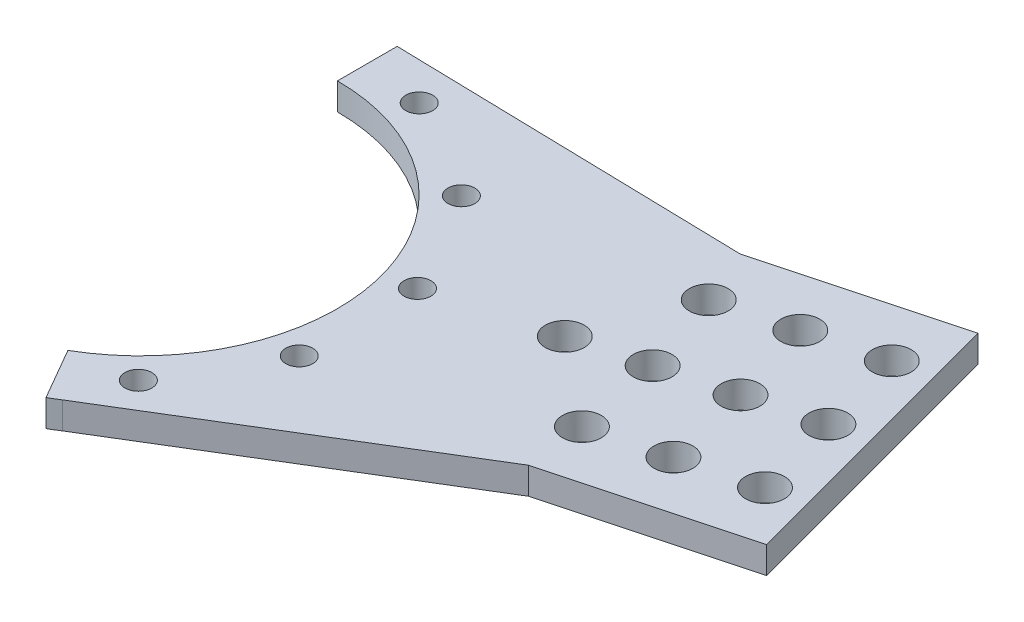
ISO-10303-21;
HEADER;
FILE_DESCRIPTION(('STEP AP214'),'2;1');
FILE_NAME('part.step','',(''),(''),'','','');
FILE_SCHEMA(('AUTOMOTIVE_DESIGN { 1 0 10303 214 1 1 1 1 }'));
ENDSEC;
DATA;
#1=APPLICATION_CONTEXT('core data for automotive mechanical design processes');
#2=APPLICATION_PROTOCOL_DEFINITION('international standard','automotive_design',2000,#1);
#3=PRODUCT_CONTEXT('',#1,'mechanical');
#4=PRODUCT('Part','Part','',(#3));
#5=PRODUCT_RELATED_PRODUCT_CATEGORY('part','',(#4));
#6=PRODUCT_DEFINITION_FORMATION('','',#4);
#7=PRODUCT_DEFINITION_CONTEXT('part definition',#1,'design');
#8=PRODUCT_DEFINITION('design','',#6,#7);
#9=PRODUCT_DEFINITION_SHAPE('','',#8);
#10=(LENGTH_UNIT() NAMED_UNIT(*) SI_UNIT(.MILLI.,.METRE.));
#11=(NAMED_UNIT(*) PLANE_ANGLE_UNIT() SI_UNIT($,.RADIAN.));
#12=(NAMED_UNIT(*) SI_UNIT($,.STERADIAN.) SOLID_ANGLE_UNIT());
#13=UNCERTAINTY_MEASURE_WITH_UNIT(LENGTH_MEASURE(1.E-05),#10,'distance_accuracy_value','');
#14=(GEOMETRIC_REPRESENTATION_CONTEXT(3) GLOBAL_UNCERTAINTY_ASSIGNED_CONTEXT((#13)) GLOBAL_UNIT_ASSIGNED_CONTEXT((#10,
#11,#12)) REPRESENTATION_CONTEXT('',''));
#15=CARTESIAN_POINT('',(0.,0.,0.));
#16=DIRECTION('',(0.,0.,1.));
#17=DIRECTION('',(1.,0.,0.));
#18=AXIS2_PLACEMENT_3D('',#15,#16,#17);
#19=CARTESIAN_POINT('',(56.0236979247659,-7.75,-15.0115046159464));
#20=DIRECTION('',(0.,1.,0.));
#21=DIRECTION('',(0.,0.,1.));
#22=AXIS2_PLACEMENT_3D('',#19,#20,#21);
#23=CYLINDRICAL_SURFACE('',#22,3.25000000000001);
#24=CARTESIAN_POINT('',(56.0236979247659,-2.25,-15.0115046159464));
#25=DIRECTION('',(0.,-1.,0.));
#26=DIRECTION('',(0.,0.,-1.));
#27=AXIS2_PLACEMENT_3D('',#24,#25,#26);
#28=CIRCLE('',#27,3.25000000000001);
#29=CARTESIAN_POINT('',(56.0236979247659,-2.25,-18.2615046159464));
#30=VERTEX_POINT('',#29);
#31=EDGE_CURVE('E42',#30,#30,#28,.T.);
#32=ORIENTED_EDGE('',*,*,#31,.T.);
#33=EDGE_LOOP('',(#32));
#34=FACE_BOUND('',#33,.T.);
#35=CARTESIAN_POINT('',(56.0236979247659,2.25,-15.0115046159464));
#36=DIRECTION('',(0.,1.,0.));
#37=DIRECTION('',(0.,0.,1.));
#38=AXIS2_PLACEMENT_3D('',#35,#36,#37);
#39=CIRCLE('',#38,3.25000000000001);
#40=CARTESIAN_POINT('',(56.0236979247659,2.25,-11.7615046159464));
#41=VERTEX_POINT('',#40);
#42=EDGE_CURVE('E11',#41,#41,#39,.T.);
#43=ORIENTED_EDGE('',*,*,#42,.T.);
#44=EDGE_LOOP('',(#43));
#45=FACE_BOUND('',#44,.T.);
#46=ADVANCED_FACE('F35',(#34,#45),#23,.F.);
#47=CARTESIAN_POINT('',(67.6148078402347,-7.75,-18.1173331571768));
#48=DIRECTION('',(0.,1.,0.));
#49=DIRECTION('',(0.,0.,1.));
#50=AXIS2_PLACEMENT_3D('',#47,#48,#49);
#51=CYLINDRICAL_SURFACE('',#50,3.25000000000001);
#52=CARTESIAN_POINT('',(67.6148078402347,-2.25,-18.1173331571768));
#53=DIRECTION('',(0.,-1.,0.));
#54=DIRECTION('',(0.,0.,-1.));
#55=AXIS2_PLACEMENT_3D('',#52,#53,#54);
#56=CIRCLE('',#55,3.25000000000001);
#57=CARTESIAN_POINT('',(67.6148078402347,-2.25,-21.3673331571768));
#58=VERTEX_POINT('',#57);
#59=EDGE_CURVE('E196',#58,#58,#56,.T.);
#60=ORIENTED_EDGE('',*,*,#59,.T.);
#61=EDGE_LOOP('',(#60));
#62=FACE_BOUND('',#61,.T.);
#63=CARTESIAN_POINT('',(67.6148078402347,2.25,-18.1173331571768));
#64=DIRECTION('',(0.,1.,0.));
#65=DIRECTION('',(0.,0.,1.));
#66=AXIS2_PLACEMENT_3D('',#63,#64,#65);
#67=CIRCLE('',#66,3.25000000000001);
#68=CARTESIAN_POINT('',(67.6148078402347,2.25,-14.8673331571768));
#69=VERTEX_POINT('',#68);
#70=EDGE_CURVE('E204',#69,#69,#67,.T.);
#71=ORIENTED_EDGE('',*,*,#70,.T.);
#72=EDGE_LOOP('',(#71));
#73=FACE_BOUND('',#72,.T.);
#74=ADVANCED_FACE('F230',(#62,#73),#51,.F.);
#75=CARTESIAN_POINT('',(0.,2.25,0.));
#76=DIRECTION('',(0.,-1.,0.));
#77=DIRECTION('',(0.,0.,-1.));
#78=AXIS2_PLACEMENT_3D('',#75,#76,#77);
#79=CYLINDRICAL_SURFACE('',#78,43.);
#80=DIRECTION('',(0.,-1.,0.));
#81=VECTOR('',#80,1.);
#82=CARTESIAN_POINT('',(23.2297705515369,2.25,36.1853252040513));
#83=LINE('',#82,#81);
#84=CARTESIAN_POINT('',(23.2297705515366,2.25,36.1853252040515));
#85=VERTEX_POINT('',#84);
#86=CARTESIAN_POINT('',(23.2297705515366,-2.25,36.1853252040515));
#87=VERTEX_POINT('',#86);
#88=EDGE_CURVE('E49',#85,#87,#83,.T.);
#89=ORIENTED_EDGE('',*,*,#88,.F.);
#90=CARTESIAN_POINT('',(0.,2.25,0.));
#91=DIRECTION('',(0.,1.,0.));
#92=DIRECTION('',(0.,0.,-1.));
#93=AXIS2_PLACEMENT_3D('',#90,#91,#92);
#94=CIRCLE('',#93,43.);
#95=CARTESIAN_POINT('',(21.4999999999998,2.25,37.239092362731));
#96=VERTEX_POINT('',#95);
#97=EDGE_CURVE('E169',#96,#85,#94,.T.);
#98=ORIENTED_EDGE('',*,*,#97,.F.);
#99=DIRECTION('',(0.,-1.,0.));
#100=VECTOR('',#99,1.);
#101=CARTESIAN_POINT('',(21.4999999999998,2.25,37.239092362731));
#102=LINE('',#101,#100);
#103=CARTESIAN_POINT('',(21.4999999999998,-2.25,37.239092362731));
#104=VERTEX_POINT('',#103);
#105=EDGE_CURVE('E178',#96,#104,#102,.T.);
#106=ORIENTED_EDGE('',*,*,#105,.T.);
#107=CARTESIAN_POINT('',(0.,-2.25,0.));
#108=DIRECTION('',(0.,1.,0.));
#109=DIRECTION('',(0.,0.,-1.));
#110=AXIS2_PLACEMENT_3D('',#107,#108,#109);
#111=CIRCLE('',#110,43.);
#112=EDGE_CURVE('E54',#104,#87,#111,.T.);
#113=ORIENTED_EDGE('',*,*,#112,.T.);
#114=EDGE_LOOP('',(#89,#98,#106,#113));
#115=FACE_BOUND('',#114,.T.);
#116=ADVANCED_FACE('F234',(#115),#79,.T.);
#117=CARTESIAN_POINT('',(103.06305875647,2.25,-1.73375885302606));
#118=DIRECTION('',(-0.258819045102531,0.,-0.965925826289065));
#119=DIRECTION('',(-0.965925826289066,0.,0.258819045102531));
#120=AXIS2_PLACEMENT_3D('',#117,#118,#119);
#121=PLANE('',#120);
#122=DIRECTION('',(0.,-1.,0.));
#123=VECTOR('',#122,1.);
#124=CARTESIAN_POINT('',(71.6635685232573,2.25,6.67970919771229));
#125=LINE('',#124,#123);
#126=CARTESIAN_POINT('',(71.6635685232573,2.25,6.67970919771258));
#127=VERTEX_POINT('',#126);
#128=CARTESIAN_POINT('',(71.6635685232573,-2.25,6.67970919771229));
#129=VERTEX_POINT('',#128);
#130=EDGE_CURVE('E126',#127,#129,#125,.T.);
#131=ORIENTED_EDGE('',*,*,#130,.T.);
#132=DIRECTION('',(0.965925826289065,0.,-0.258819045102531));
#133=VECTOR('',#132,1.);
#134=CARTESIAN_POINT('',(103.06305875647,-2.25,-1.73375885302606));
#135=LINE('',#134,#133);
#136=CARTESIAN_POINT('',(103.06305875647,-2.25,-1.73375885302606));
#137=VERTEX_POINT('',#136);
#138=EDGE_CURVE('E111',#129,#137,#135,.T.);
#139=ORIENTED_EDGE('',*,*,#138,.T.);
#140=DIRECTION('',(0.,-1.,0.));
#141=VECTOR('',#140,1.);
#142=CARTESIAN_POINT('',(103.06305875647,2.25,-1.73375885302606));
#143=LINE('',#142,#141);
#144=CARTESIAN_POINT('',(103.06305875647,2.25,-1.73375885302606));
#145=VERTEX_POINT('',#144);
#146=EDGE_CURVE('E161',#145,#137,#143,.T.);
#147=ORIENTED_EDGE('',*,*,#146,.F.);
#148=DIRECTION('',(0.965925826289065,0.,-0.258819045102531));
#149=VECTOR('',#148,1.);
#150=CARTESIAN_POINT('',(103.06305875647,2.25,-1.73375885302606));
#151=LINE('',#150,#149);
#152=EDGE_CURVE('E128',#127,#145,#151,.T.);
#153=ORIENTED_EDGE('',*,*,#152,.F.);
#154=EDGE_LOOP('',(#131,#139,#147,#153));
#155=FACE_BOUND('',#154,.T.);
#156=ADVANCED_FACE('F127',(#155),#121,.F.);
#157=DIRECTION('',(0.,-1.,0.));
#158=VECTOR('',#157,1.);
#159=CARTESIAN_POINT('',(2.0249088196889,2.25,-42.9522961466782));
#160=LINE('',#159,#158);
#161=CARTESIAN_POINT('',(2.02490881968804,-2.25,-42.9522961466782));
#162=VERTEX_POINT('',#161);
#163=CARTESIAN_POINT('',(2.02490881968804,2.25,-42.9522961466782));
#164=VERTEX_POINT('',#163);
#165=EDGE_CURVE('E152',#162,#164,#160,.F.);
#166=ORIENTED_EDGE('',*,*,#165,.F.);
#167=CARTESIAN_POINT('',(0.,-2.25,-43.));
#168=VERTEX_POINT('',#167);
#169=EDGE_CURVE('E168',#162,#168,#111,.T.);
#170=ORIENTED_EDGE('',*,*,#169,.T.);
#171=DIRECTION('',(0.,-1.,0.));
#172=VECTOR('',#171,1.);
#173=CARTESIAN_POINT('',(0.,2.25,-43.));
#174=LINE('',#173,#172);
#175=CARTESIAN_POINT('',(0.,2.25,-43.));
#176=VERTEX_POINT('',#175);
#177=EDGE_CURVE('E193',#176,#168,#174,.T.);
#178=ORIENTED_EDGE('',*,*,#177,.F.);
#179=EDGE_CURVE('E172',#164,#176,#94,.T.);
#180=ORIENTED_EDGE('',*,*,#179,.F.);
#181=EDGE_LOOP('',(#166,#170,#178,#180));
#182=FACE_BOUND('',#181,.T.);
#183=ADVANCED_FACE('F240',(#182),#79,.T.);
#184=CARTESIAN_POINT('',(90.1221065013434,2.25,-50.0300501674793));
#185=DIRECTION('',(0.258819045102531,0.,0.965925826289065));
#186=DIRECTION('',(0.965925826289066,0.,-0.258819045102531));
#187=AXIS2_PLACEMENT_3D('',#184,#185,#186);
#188=PLANE('',#187);
#189=DIRECTION('',(0.,-1.,0.));
#190=VECTOR('',#189,1.);
#191=CARTESIAN_POINT('',(58.722616268131,2.25,-41.6165821167408));
#192=LINE('',#191,#190);
#193=CARTESIAN_POINT('',(58.722616268131,2.25,-41.6165821167408));
#194=VERTEX_POINT('',#193);
#195=CARTESIAN_POINT('',(58.722616268131,-2.25,-41.6165821167408));
#196=VERTEX_POINT('',#195);
#197=EDGE_CURVE('E147',#194,#196,#192,.T.);
#198=ORIENTED_EDGE('',*,*,#197,.F.);
#199=DIRECTION('',(-0.965925826289066,0.,0.258819045102531));
#200=VECTOR('',#199,1.);
#201=CARTESIAN_POINT('',(90.1221065013434,2.25,-50.0300501674793));
#202=LINE('',#201,#200);
#203=CARTESIAN_POINT('',(90.1221065013434,2.25,-50.0300501674793));
#204=VERTEX_POINT('',#203);
#205=EDGE_CURVE('E157',#204,#194,#202,.T.);
#206=ORIENTED_EDGE('',*,*,#205,.F.);
#207=DIRECTION('',(0.,-1.,0.));
#208=VECTOR('',#207,1.);
#209=CARTESIAN_POINT('',(90.1221065013434,2.25,-50.0300501674793));
#210=LINE('',#209,#208);
#211=CARTESIAN_POINT('',(90.1221065013434,-2.25,-50.0300501674793));
#212=VERTEX_POINT('',#211);
#213=EDGE_CURVE('E165',#204,#212,#210,.T.);
#214=ORIENTED_EDGE('',*,*,#213,.T.);
#215=DIRECTION('',(-0.965925826289066,0.,0.258819045102531));
#216=VECTOR('',#215,1.);
#217=CARTESIAN_POINT('',(90.1221065013434,-2.25,-50.0300501674793));
#218=LINE('',#217,#216);
#219=EDGE_CURVE('E123',#212,#196,#218,.T.);
#220=ORIENTED_EDGE('',*,*,#219,.T.);
#221=EDGE_LOOP('',(#198,#206,#214,#220));
#222=FACE_BOUND('',#221,.T.);
#223=ADVANCED_FACE('F244',(#222),#188,.F.);
#224=CARTESIAN_POINT('',(0.,2.25,-33.));
#225=DIRECTION('',(1.,0.,0.));
#226=DIRECTION('',(0.,0.,-1.));
#227=AXIS2_PLACEMENT_3D('',#224,#225,#226);
#228=PLANE('',#227);
#229=DIRECTION('',(0.,0.,1.));
#230=VECTOR('',#229,1.);
#231=CARTESIAN_POINT('',(0.,-2.25,-33.));
#232=LINE('',#231,#230);
#233=CARTESIAN_POINT('',(0.,-2.25,-33.));
#234=VERTEX_POINT('',#233);
#235=EDGE_CURVE('E180',#168,#234,#232,.T.);
#236=ORIENTED_EDGE('',*,*,#235,.T.);
#237=DIRECTION('',(0.,-1.,0.));
#238=VECTOR('',#237,1.);
#239=CARTESIAN_POINT('',(0.,2.25,-33.));
#240=LINE('',#239,#238);
#241=CARTESIAN_POINT('',(0.,2.25,-33.));
#242=VERTEX_POINT('',#241);
#243=EDGE_CURVE('E190',#242,#234,#240,.T.);
#244=ORIENTED_EDGE('',*,*,#243,.F.);
#245=DIRECTION('',(0.,0.,1.));
#246=VECTOR('',#245,1.);
#247=CARTESIAN_POINT('',(0.,2.25,-33.));
#248=LINE('',#247,#246);
#249=EDGE_CURVE('E171',#176,#242,#248,.T.);
#250=ORIENTED_EDGE('',*,*,#249,.F.);
#251=ORIENTED_EDGE('',*,*,#177,.T.);
#252=EDGE_LOOP('',(#236,#244,#250,#251));
#253=FACE_BOUND('',#252,.T.);
#254=ADVANCED_FACE('F246',(#253),#228,.F.);
#255=CARTESIAN_POINT('',(0.,2.25,0.));
#256=DIRECTION('',(0.,-1.,0.));
#257=DIRECTION('',(0.,0.,-1.));
#258=AXIS2_PLACEMENT_3D('',#255,#256,#257);
#259=CYLINDRICAL_SURFACE('',#258,33.);
#260=CARTESIAN_POINT('',(0.,-2.25,0.));
#261=DIRECTION('',(0.,-1.,0.));
#262=DIRECTION('',(0.,0.,-1.));
#263=AXIS2_PLACEMENT_3D('',#260,#261,#262);
#264=CIRCLE('',#263,33.);
#265=CARTESIAN_POINT('',(16.4999999999998,-2.25,28.5788383248866));
#266=VERTEX_POINT('',#265);
#267=EDGE_CURVE('E182',#234,#266,#264,.T.);
#268=ORIENTED_EDGE('',*,*,#267,.T.);
#269=DIRECTION('',(0.,-1.,0.));
#270=VECTOR('',#269,1.);
#271=CARTESIAN_POINT('',(16.4999999999998,2.25,28.5788383248866));
#272=LINE('',#271,#270);
#273=CARTESIAN_POINT('',(16.4999999999998,2.25,28.5788383248866));
#274=VERTEX_POINT('',#273);
#275=EDGE_CURVE('E187',#274,#266,#272,.T.);
#276=ORIENTED_EDGE('',*,*,#275,.F.);
#277=CARTESIAN_POINT('',(0.,2.25,0.));
#278=DIRECTION('',(0.,-1.,0.));
#279=DIRECTION('',(0.,0.,-1.));
#280=AXIS2_PLACEMENT_3D('',#277,#278,#279);
#281=CIRCLE('',#280,33.);
#282=EDGE_CURVE('E174',#242,#274,#281,.T.);
#283=ORIENTED_EDGE('',*,*,#282,.F.);
#284=ORIENTED_EDGE('',*,*,#243,.T.);
#285=EDGE_LOOP('',(#268,#276,#283,#284));
#286=FACE_BOUND('',#285,.T.);
#287=ADVANCED_FACE('F249',(#286),#259,.F.);
#288=CARTESIAN_POINT('',(16.4999999999998,2.25,28.5788383248866));
#289=DIRECTION('',(0.866025403784441,0.,-0.499999999999995));
#290=DIRECTION('',(-0.499999999999995,0.,-0.866025403784441));
#291=AXIS2_PLACEMENT_3D('',#288,#289,#290);
#292=PLANE('',#291);
#293=DIRECTION('',(0.499999999999995,0.,0.866025403784441));
#294=VECTOR('',#293,1.);
#295=CARTESIAN_POINT('',(16.4999999999998,-2.25,28.5788383248866));
#296=LINE('',#295,#294);
#297=EDGE_CURVE('E184',#266,#104,#296,.T.);
#298=ORIENTED_EDGE('',*,*,#297,.T.);
#299=ORIENTED_EDGE('',*,*,#105,.F.);
#300=DIRECTION('',(0.499999999999995,0.,0.866025403784441));
#301=VECTOR('',#300,1.);
#302=CARTESIAN_POINT('',(16.4999999999998,2.25,28.5788383248866));
#303=LINE('',#302,#301);
#304=EDGE_CURVE('E176',#274,#96,#303,.T.);
#305=ORIENTED_EDGE('',*,*,#304,.F.);
#306=ORIENTED_EDGE('',*,*,#275,.T.);
#307=EDGE_LOOP('',(#298,#299,#305,#306));
#308=FACE_BOUND('',#307,.T.);
#309=ADVANCED_FACE('F223',(#308),#292,.F.);
#310=CARTESIAN_POINT('',(0.,2.25,0.));
#311=DIRECTION('',(0.,-1.,0.));
#312=DIRECTION('',(0.,0.,-1.));
#313=AXIS2_PLACEMENT_3D('',#310,#311,#312);
#314=PLANE('',#313);
#315=CARTESIAN_POINT('',(79.2059177557035,2.25,-21.2231616984072));
#316=DIRECTION('',(0.,1.,0.));
#317=DIRECTION('',(0.,0.,1.));
#318=AXIS2_PLACEMENT_3D('',#315,#316,#317);
#319=CIRCLE('',#318,3.25000000000001);
#320=CARTESIAN_POINT('',(79.2059177557035,2.25,-17.9731616984071));
#321=VERTEX_POINT('',#320);
#322=EDGE_CURVE('E345',#321,#321,#319,.T.);
#323=ORIENTED_EDGE('',*,*,#322,.F.);
#324=EDGE_LOOP('',(#323));
#325=FACE_BOUND('',#324,.T.);
#326=CARTESIAN_POINT('',(90.7970276711723,2.25,-24.3289902396375));
#327=DIRECTION('',(0.,1.,0.));
#328=DIRECTION('',(0.,0.,1.));
#329=AXIS2_PLACEMENT_3D('',#326,#327,#328);
#330=CIRCLE('',#329,3.25000000000001);
#331=CARTESIAN_POINT('',(90.7970276711723,2.25,-21.0789902396375));
#332=VERTEX_POINT('',#331);
#333=EDGE_CURVE('E201',#332,#332,#330,.T.);
#334=ORIENTED_EDGE('',*,*,#333,.F.);
#335=EDGE_LOOP('',(#334));
#336=FACE_BOUND('',#335,.T.);
#337=CARTESIAN_POINT('',(82.6052405190969,2.25,-6.60486478151987));
#338=DIRECTION('',(0.,-1.,0.));
#339=DIRECTION('',(0.,0.,-1.));
#340=AXIS2_PLACEMENT_3D('',#337,#338,#339);
#341=CIRCLE('',#340,3.25000000000001);
#342=CARTESIAN_POINT('',(82.6052405190969,2.25,-9.85486478151988));
#343=VERTEX_POINT('',#342);
#344=EDGE_CURVE('E371',#343,#343,#341,.T.);
#345=ORIENTED_EDGE('',*,*,#344,.T.);
#346=EDGE_LOOP('',(#345));
#347=FACE_BOUND('',#346,.T.);
#348=CARTESIAN_POINT('',(74.840669166021,2.25,-35.5826395701919));
#349=DIRECTION('',(0.,-1.,0.));
#350=DIRECTION('',(0.,0.,-1.));
#351=AXIS2_PLACEMENT_3D('',#348,#349,#350);
#352=CIRCLE('',#351,3.25000000000001);
#353=CARTESIAN_POINT('',(74.840669166021,2.25,-38.8326395701919));
#354=VERTEX_POINT('',#353);
#355=EDGE_CURVE('E368',#354,#354,#352,.T.);
#356=ORIENTED_EDGE('',*,*,#355,.T.);
#357=EDGE_LOOP('',(#356));
#358=FACE_BOUND('',#357,.T.);
#359=CARTESIAN_POINT('',(70.5311676904836,2.25,-3.36962671773823));
#360=DIRECTION('',(0.,-1.,0.));
#361=DIRECTION('',(0.,0.,-1.));
#362=AXIS2_PLACEMENT_3D('',#359,#360,#361);
#363=CIRCLE('',#362,3.25000000000001);
#364=CARTESIAN_POINT('',(70.5311676904836,2.25,-6.61962671773824));
#365=VERTEX_POINT('',#364);
#366=EDGE_CURVE('E365',#365,#365,#363,.T.);
#367=ORIENTED_EDGE('',*,*,#366,.T.);
#368=EDGE_LOOP('',(#367));
#369=FACE_BOUND('',#368,.T.);
#370=CARTESIAN_POINT('',(62.7665963374077,2.25,-32.3474015064102));
#371=DIRECTION('',(0.,-1.,0.));
#372=DIRECTION('',(0.,0.,-1.));
#373=AXIS2_PLACEMENT_3D('',#370,#371,#372);
#374=CIRCLE('',#373,3.25000000000001);
#375=CARTESIAN_POINT('',(62.7665963374077,2.25,-35.5974015064102));
#376=VERTEX_POINT('',#375);
#377=EDGE_CURVE('E354',#376,#376,#374,.T.);
#378=ORIENTED_EDGE('',*,*,#377,.T.);
#379=EDGE_LOOP('',(#378));
#380=FACE_BOUND('',#379,.T.);
#381=CARTESIAN_POINT('',(94.6793133477102,2.25,-9.84010284530152));
#382=DIRECTION('',(0.,-1.,0.));
#383=DIRECTION('',(0.,0.,-1.));
#384=AXIS2_PLACEMENT_3D('',#381,#382,#383);
#385=CIRCLE('',#384,3.25000000000001);
#386=CARTESIAN_POINT('',(94.6793133477102,2.25,-13.0901028453015));
#387=VERTEX_POINT('',#386);
#388=EDGE_CURVE('E383',#387,#387,#385,.T.);
#389=ORIENTED_EDGE('',*,*,#388,.T.);
#390=EDGE_LOOP('',(#389));
#391=FACE_BOUND('',#390,.T.);
#392=CARTESIAN_POINT('',(86.9147419946343,2.25,-38.8178776339735));
#393=DIRECTION('',(0.,-1.,0.));
#394=DIRECTION('',(0.,0.,-1.));
#395=AXIS2_PLACEMENT_3D('',#392,#393,#394);
#396=CIRCLE('',#395,3.25000000000001);
#397=CARTESIAN_POINT('',(86.9147419946343,2.25,-42.0678776339735));
#398=VERTEX_POINT('',#397);
#399=EDGE_CURVE('E378',#398,#398,#396,.T.);
#400=ORIENTED_EDGE('',*,*,#399,.T.);
#401=EDGE_LOOP('',(#400));
#402=FACE_BOUND('',#401,.T.);
#403=CARTESIAN_POINT('',(36.6520508829246,2.25,10.0313092901925));
#404=DIRECTION('',(0.,-1.,0.));
#405=DIRECTION('',(0.,0.,-1.));
#406=AXIS2_PLACEMENT_3D('',#403,#404,#405);
#407=CIRCLE('',#406,2.25);
#408=CARTESIAN_POINT('',(36.6520508829246,2.25,7.78130929019255));
#409=VERTEX_POINT('',#408);
#410=EDGE_CURVE('E407',#409,#409,#407,.T.);
#411=ORIENTED_EDGE('',*,*,#410,.T.);
#412=EDGE_LOOP('',(#411));
#413=FACE_BOUND('',#412,.T.);
#414=CARTESIAN_POINT('',(26.7259525203163,2.25,27.0133941199879));
#415=DIRECTION('',(0.,-1.,0.));
#416=DIRECTION('',(0.,0.,-1.));
#417=AXIS2_PLACEMENT_3D('',#414,#415,#416);
#418=CIRCLE('',#417,2.25);
#419=CARTESIAN_POINT('',(26.7259525203163,2.25,24.7633941199879));
#420=VERTEX_POINT('',#419);
#421=EDGE_CURVE('E404',#420,#420,#418,.T.);
#422=ORIENTED_EDGE('',*,*,#421,.T.);
#423=EDGE_LOOP('',(#422));
#424=FACE_BOUND('',#423,.T.);
#425=CARTESIAN_POINT('',(27.0133941199878,2.25,-26.7259525203164));
#426=DIRECTION('',(0.,-1.,0.));
#427=DIRECTION('',(0.,0.,-1.));
#428=AXIS2_PLACEMENT_3D('',#425,#426,#427);
#429=CIRCLE('',#428,2.25);
#430=CARTESIAN_POINT('',(27.0133941199878,2.25,-28.9759525203164));
#431=VERTEX_POINT('',#430);
#432=EDGE_CURVE('E401',#431,#431,#429,.T.);
#433=ORIENTED_EDGE('',*,*,#432,.T.);
#434=EDGE_LOOP('',(#433));
#435=FACE_BOUND('',#434,.T.);
#436=CARTESIAN_POINT('',(10.0313092901924,2.25,-36.6520508829247));
#437=DIRECTION('',(0.,-1.,0.));
#438=DIRECTION('',(0.,0.,-1.));
#439=AXIS2_PLACEMENT_3D('',#436,#437,#438);
#440=CIRCLE('',#439,2.25);
#441=CARTESIAN_POINT('',(10.0313092901924,2.25,-38.9020508829247));
#442=VERTEX_POINT('',#441);
#443=EDGE_CURVE('E390',#442,#442,#440,.T.);
#444=ORIENTED_EDGE('',*,*,#443,.T.);
#445=EDGE_LOOP('',(#444));
#446=FACE_BOUND('',#445,.T.);
#447=CARTESIAN_POINT('',(36.7572618105089,2.25,-9.63865676293677));
#448=DIRECTION('',(0.,-1.,0.));
#449=DIRECTION('',(0.,0.,-1.));
#450=AXIS2_PLACEMENT_3D('',#447,#448,#449);
#451=CIRCLE('',#450,2.25);
#452=CARTESIAN_POINT('',(36.7572618105089,2.25,-11.8886567629368));
#453=VERTEX_POINT('',#452);
#454=EDGE_CURVE('E135',#453,#453,#451,.T.);
#455=ORIENTED_EDGE('',*,*,#454,.T.);
#456=EDGE_LOOP('',(#455));
#457=FACE_BOUND('',#456,.T.);
#458=ORIENTED_EDGE('',*,*,#97,.T.);
#459=DIRECTION('',(0.854009187870222,0.,-0.520257923566037));
#460=VECTOR('',#459,1.);
#461=CARTESIAN_POINT('',(21.5000000000005,2.25,37.2390923627306));
#462=LINE('',#461,#460);
#463=EDGE_CURVE('E132',#85,#127,#462,.T.);
#464=ORIENTED_EDGE('',*,*,#463,.T.);
#465=ORIENTED_EDGE('',*,*,#152,.T.);
#466=DIRECTION('',(-0.258819045102531,0.,-0.965925826289066));
#467=VECTOR('',#466,1.);
#468=CARTESIAN_POINT('',(90.1221065013434,2.25,-50.0300501674793));
#469=LINE('',#468,#467);
#470=EDGE_CURVE('E122',#145,#204,#469,.T.);
#471=ORIENTED_EDGE('',*,*,#470,.T.);
#472=ORIENTED_EDGE('',*,*,#205,.T.);
#473=DIRECTION('',(-0.999722613543948,0.,-0.0235519843932077));
#474=VECTOR('',#473,1.);
#475=CARTESIAN_POINT('',(0.,2.25,-43.));
#476=LINE('',#475,#474);
#477=EDGE_CURVE('E144',#194,#164,#476,.T.);
#478=ORIENTED_EDGE('',*,*,#477,.T.);
#479=ORIENTED_EDGE('',*,*,#179,.T.);
#480=ORIENTED_EDGE('',*,*,#249,.T.);
#481=ORIENTED_EDGE('',*,*,#282,.T.);
#482=ORIENTED_EDGE('',*,*,#304,.T.);
#483=EDGE_LOOP('',(#458,#464,#465,#471,#472,#478,#479,#480,#481,#482));
#484=FACE_BOUND('',#483,.T.);
#485=ORIENTED_EDGE('',*,*,#70,.F.);
#486=EDGE_LOOP('',(#485));
#487=FACE_BOUND('',#486,.T.);
#488=ORIENTED_EDGE('',*,*,#42,.F.);
#489=EDGE_LOOP('',(#488));
#490=FACE_BOUND('',#489,.T.);
#491=ADVANCED_FACE('F213',(#325,#336,#347,#358,#369,#380,#391,#402,#413,#424,#435,#446,#457,
#484,#487,#490),#314,.F.);
#492=CARTESIAN_POINT('',(0.,-2.25,0.));
#493=DIRECTION('',(0.,-1.,0.));
#494=DIRECTION('',(0.,0.,-1.));
#495=AXIS2_PLACEMENT_3D('',#492,#493,#494);
#496=PLANE('',#495);
#497=CARTESIAN_POINT('',(79.2059177557035,-2.25,-21.2231616984072));
#498=DIRECTION('',(0.,-1.,0.));
#499=DIRECTION('',(0.,0.,-1.));
#500=AXIS2_PLACEMENT_3D('',#497,#498,#499);
#501=CIRCLE('',#500,3.25000000000001);
#502=CARTESIAN_POINT('',(79.2059177557035,-2.25,-24.4731616984072));
#503=VERTEX_POINT('',#502);
#504=EDGE_CURVE('E342',#503,#503,#501,.T.);
#505=ORIENTED_EDGE('',*,*,#504,.F.);
#506=EDGE_LOOP('',(#505));
#507=FACE_BOUND('',#506,.T.);
#508=CARTESIAN_POINT('',(90.7970276711723,-2.25,-24.3289902396375));
#509=DIRECTION('',(0.,-1.,0.));
#510=DIRECTION('',(0.,0.,-1.));
#511=AXIS2_PLACEMENT_3D('',#508,#509,#510);
#512=CIRCLE('',#511,3.25000000000001);
#513=CARTESIAN_POINT('',(90.7970276711723,-2.25,-27.5789902396375));
#514=VERTEX_POINT('',#513);
#515=EDGE_CURVE('E197',#514,#514,#512,.T.);
#516=ORIENTED_EDGE('',*,*,#515,.F.);
#517=EDGE_LOOP('',(#516));
#518=FACE_BOUND('',#517,.T.);
#519=CARTESIAN_POINT('',(82.6052405190969,-2.25,-6.60486478151987));
#520=DIRECTION('',(0.,1.,0.));
#521=DIRECTION('',(0.,0.,1.));
#522=AXIS2_PLACEMENT_3D('',#519,#520,#521);
#523=CIRCLE('',#522,3.25000000000001);
#524=CARTESIAN_POINT('',(82.6052405190969,-2.25,-3.35486478151987));
#525=VERTEX_POINT('',#524);
#526=EDGE_CURVE('E351',#525,#525,#523,.T.);
#527=ORIENTED_EDGE('',*,*,#526,.T.);
#528=EDGE_LOOP('',(#527));
#529=FACE_BOUND('',#528,.T.);
#530=CARTESIAN_POINT('',(74.840669166021,-2.25,-35.5826395701919));
#531=DIRECTION('',(0.,1.,0.));
#532=DIRECTION('',(0.,0.,1.));
#533=AXIS2_PLACEMENT_3D('',#530,#531,#532);
#534=CIRCLE('',#533,3.25000000000001);
#535=CARTESIAN_POINT('',(74.840669166021,-2.25,-32.3326395701918));
#536=VERTEX_POINT('',#535);
#537=EDGE_CURVE('E355',#536,#536,#534,.T.);
#538=ORIENTED_EDGE('',*,*,#537,.T.);
#539=EDGE_LOOP('',(#538));
#540=FACE_BOUND('',#539,.T.);
#541=CARTESIAN_POINT('',(70.5311676904836,-2.25,-3.36962671773823));
#542=DIRECTION('',(0.,1.,0.));
#543=DIRECTION('',(0.,0.,1.));
#544=AXIS2_PLACEMENT_3D('',#541,#542,#543);
#545=CIRCLE('',#544,3.25000000000001);
#546=CARTESIAN_POINT('',(70.5311676904836,-2.25,-0.119626717738222));
#547=VERTEX_POINT('',#546);
#548=EDGE_CURVE('E358',#547,#547,#545,.T.);
#549=ORIENTED_EDGE('',*,*,#548,.T.);
#550=EDGE_LOOP('',(#549));
#551=FACE_BOUND('',#550,.T.);
#552=CARTESIAN_POINT('',(62.7665963374077,-2.25,-32.3474015064102));
#553=DIRECTION('',(0.,1.,0.));
#554=DIRECTION('',(0.,0.,1.));
#555=AXIS2_PLACEMENT_3D('',#552,#553,#554);
#556=CIRCLE('',#555,3.25000000000001);
#557=CARTESIAN_POINT('',(62.7665963374077,-2.25,-29.0974015064102));
#558=VERTEX_POINT('',#557);
#559=EDGE_CURVE('E200',#558,#558,#556,.T.);
#560=ORIENTED_EDGE('',*,*,#559,.T.);
#561=EDGE_LOOP('',(#560));
#562=FACE_BOUND('',#561,.T.);
#563=CARTESIAN_POINT('',(94.6793133477102,-2.25,-9.84010284530152));
#564=DIRECTION('',(0.,1.,0.));
#565=DIRECTION('',(0.,0.,1.));
#566=AXIS2_PLACEMENT_3D('',#563,#564,#565);
#567=CIRCLE('',#566,3.25000000000001);
#568=CARTESIAN_POINT('',(94.6793133477102,-2.25,-6.59010284530151));
#569=VERTEX_POINT('',#568);
#570=EDGE_CURVE('E375',#569,#569,#567,.T.);
#571=ORIENTED_EDGE('',*,*,#570,.T.);
#572=EDGE_LOOP('',(#571));
#573=FACE_BOUND('',#572,.T.);
#574=CARTESIAN_POINT('',(86.9147419946343,-2.25,-38.8178776339735));
#575=DIRECTION('',(0.,1.,0.));
#576=DIRECTION('',(0.,0.,1.));
#577=AXIS2_PLACEMENT_3D('',#574,#575,#576);
#578=CIRCLE('',#577,3.25000000000001);
#579=CARTESIAN_POINT('',(86.9147419946343,-2.25,-35.5678776339735));
#580=VERTEX_POINT('',#579);
#581=EDGE_CURVE('E374',#580,#580,#578,.T.);
#582=ORIENTED_EDGE('',*,*,#581,.T.);
#583=EDGE_LOOP('',(#582));
#584=FACE_BOUND('',#583,.T.);
#585=CARTESIAN_POINT('',(36.6520508829246,-2.25,10.0313092901925));
#586=DIRECTION('',(0.,1.,0.));
#587=DIRECTION('',(-0.500000000000001,0.,0.866025403784438));
#588=AXIS2_PLACEMENT_3D('',#585,#586,#587);
#589=CIRCLE('',#588,2.25);
#590=CARTESIAN_POINT('',(35.5270508829246,-2.25,11.9798664487075));
#591=VERTEX_POINT('',#590);
#592=EDGE_CURVE('E387',#591,#591,#589,.T.);
#593=ORIENTED_EDGE('',*,*,#592,.T.);
#594=EDGE_LOOP('',(#593));
#595=FACE_BOUND('',#594,.T.);
#596=CARTESIAN_POINT('',(26.7259525203163,-2.25,27.0133941199879));
#597=DIRECTION('',(0.,1.,0.));
#598=DIRECTION('',(-0.86602540378444,0.,0.499999999999998));
#599=AXIS2_PLACEMENT_3D('',#596,#597,#598);
#600=CIRCLE('',#599,2.25);
#601=CARTESIAN_POINT('',(24.7773953618013,-2.25,28.1383941199879));
#602=VERTEX_POINT('',#601);
#603=EDGE_CURVE('E391',#602,#602,#600,.T.);
#604=ORIENTED_EDGE('',*,*,#603,.T.);
#605=EDGE_LOOP('',(#604));
#606=FACE_BOUND('',#605,.T.);
#607=CARTESIAN_POINT('',(27.0133941199878,-2.25,-26.7259525203164));
#608=DIRECTION('',(0.,1.,0.));
#609=DIRECTION('',(0.500000000000001,0.,0.866025403784438));
#610=AXIS2_PLACEMENT_3D('',#607,#608,#609);
#611=CIRCLE('',#610,2.25);
#612=CARTESIAN_POINT('',(28.1383941199878,-2.25,-24.7773953618014));
#613=VERTEX_POINT('',#612);
#614=EDGE_CURVE('E394',#613,#613,#611,.T.);
#615=ORIENTED_EDGE('',*,*,#614,.T.);
#616=EDGE_LOOP('',(#615));
#617=FACE_BOUND('',#616,.T.);
#618=CARTESIAN_POINT('',(10.0313092901924,-2.25,-36.6520508829247));
#619=DIRECTION('',(0.,1.,0.));
#620=DIRECTION('',(0.86602540378444,0.,0.499999999999998));
#621=AXIS2_PLACEMENT_3D('',#618,#619,#620);
#622=CIRCLE('',#621,2.25);
#623=CARTESIAN_POINT('',(11.9798664487074,-2.25,-35.5270508829247));
#624=VERTEX_POINT('',#623);
#625=EDGE_CURVE('E386',#624,#624,#622,.T.);
#626=ORIENTED_EDGE('',*,*,#625,.T.);
#627=EDGE_LOOP('',(#626));
#628=FACE_BOUND('',#627,.T.);
#629=CARTESIAN_POINT('',(36.7572618105089,-2.25,-9.63865676293677));
#630=DIRECTION('',(0.,1.,0.));
#631=DIRECTION('',(0.,0.,1.));
#632=AXIS2_PLACEMENT_3D('',#629,#630,#631);
#633=CIRCLE('',#632,2.25);
#634=CARTESIAN_POINT('',(36.7572618105089,-2.25,-7.38865676293677));
#635=VERTEX_POINT('',#634);
#636=EDGE_CURVE('E139',#635,#635,#633,.T.);
#637=ORIENTED_EDGE('',*,*,#636,.T.);
#638=EDGE_LOOP('',(#637));
#639=FACE_BOUND('',#638,.T.);
#640=DIRECTION('',(0.854009187870222,0.,-0.520257923566037));
#641=VECTOR('',#640,1.);
#642=CARTESIAN_POINT('',(21.5000000000005,-2.25,37.2390923627306));
#643=LINE('',#642,#641);
#644=EDGE_CURVE('E116',#87,#129,#643,.T.);
#645=ORIENTED_EDGE('',*,*,#644,.F.);
#646=ORIENTED_EDGE('',*,*,#112,.F.);
#647=ORIENTED_EDGE('',*,*,#297,.F.);
#648=ORIENTED_EDGE('',*,*,#267,.F.);
#649=ORIENTED_EDGE('',*,*,#235,.F.);
#650=ORIENTED_EDGE('',*,*,#169,.F.);
#651=DIRECTION('',(-0.999722613543948,0.,-0.0235519843932077));
#652=VECTOR('',#651,1.);
#653=CARTESIAN_POINT('',(0.,-2.25,-43.));
#654=LINE('',#653,#652);
#655=EDGE_CURVE('E143',#196,#162,#654,.T.);
#656=ORIENTED_EDGE('',*,*,#655,.F.);
#657=ORIENTED_EDGE('',*,*,#219,.F.);
#658=DIRECTION('',(-0.258819045102531,0.,-0.965925826289066));
#659=VECTOR('',#658,1.);
#660=CARTESIAN_POINT('',(90.1221065013434,-2.25,-50.0300501674793));
#661=LINE('',#660,#659);
#662=EDGE_CURVE('E118',#137,#212,#661,.T.);
#663=ORIENTED_EDGE('',*,*,#662,.F.);
#664=ORIENTED_EDGE('',*,*,#138,.F.);
#665=EDGE_LOOP('',(#645,#646,#647,#648,#649,#650,#656,#657,#663,#664));
#666=FACE_BOUND('',#665,.T.);
#667=ORIENTED_EDGE('',*,*,#59,.F.);
#668=EDGE_LOOP('',(#667));
#669=FACE_BOUND('',#668,.T.);
#670=ORIENTED_EDGE('',*,*,#31,.F.);
#671=EDGE_LOOP('',(#670));
#672=FACE_BOUND('',#671,.T.);
#673=ADVANCED_FACE('F113',(#507,#518,#529,#540,#551,#562,#573,#584,#595,#606,#617,#628,#639,
#666,#669,#672),#496,.T.);
#674=CARTESIAN_POINT('',(90.1221065013434,2.25,-50.0300501674793));
#675=DIRECTION('',(-0.965925826289065,0.,0.258819045102531));
#676=DIRECTION('',(0.258819045102531,0.,0.965925826289066));
#677=AXIS2_PLACEMENT_3D('',#674,#675,#676);
#678=PLANE('',#677);
#679=ORIENTED_EDGE('',*,*,#662,.T.);
#680=ORIENTED_EDGE('',*,*,#213,.F.);
#681=ORIENTED_EDGE('',*,*,#470,.F.);
#682=ORIENTED_EDGE('',*,*,#146,.T.);
#683=EDGE_LOOP('',(#679,#680,#681,#682));
#684=FACE_BOUND('',#683,.T.);
#685=ADVANCED_FACE('F212',(#684),#678,.F.);
#686=CARTESIAN_POINT('',(0.,2.25,-43.));
#687=DIRECTION('',(-0.0235519843932077,0.,0.999722613543948));
#688=DIRECTION('',(0.999722613543948,0.,0.0235519843932077));
#689=AXIS2_PLACEMENT_3D('',#686,#687,#688);
#690=PLANE('',#689);
#691=ORIENTED_EDGE('',*,*,#655,.T.);
#692=ORIENTED_EDGE('',*,*,#165,.T.);
#693=ORIENTED_EDGE('',*,*,#477,.F.);
#694=ORIENTED_EDGE('',*,*,#197,.T.);
#695=EDGE_LOOP('',(#691,#692,#693,#694));
#696=FACE_BOUND('',#695,.T.);
#697=ADVANCED_FACE('F220',(#696),#690,.F.);
#698=CARTESIAN_POINT('',(21.5000000000005,2.25,37.2390923627306));
#699=DIRECTION('',(-0.520257923566037,0.,-0.854009187870221));
#700=DIRECTION('',(-0.854009187870222,0.,0.520257923566037));
#701=AXIS2_PLACEMENT_3D('',#698,#699,#700);
#702=PLANE('',#701);
#703=ORIENTED_EDGE('',*,*,#463,.F.);
#704=ORIENTED_EDGE('',*,*,#88,.T.);
#705=ORIENTED_EDGE('',*,*,#644,.T.);
#706=ORIENTED_EDGE('',*,*,#130,.F.);
#707=EDGE_LOOP('',(#703,#704,#705,#706));
#708=FACE_BOUND('',#707,.T.);
#709=ADVANCED_FACE('F134',(#708),#702,.F.);
#710=CARTESIAN_POINT('',(36.7572618105089,-2.25,-9.63865676293677));
#711=DIRECTION('',(0.,1.,0.));
#712=DIRECTION('',(0.,0.,1.));
#713=AXIS2_PLACEMENT_3D('',#710,#711,#712);
#714=CYLINDRICAL_SURFACE('',#713,2.25);
#715=ORIENTED_EDGE('',*,*,#636,.F.);
#716=EDGE_LOOP('',(#715));
#717=FACE_BOUND('',#716,.T.);
#718=ORIENTED_EDGE('',*,*,#454,.F.);
#719=EDGE_LOOP('',(#718));
#720=FACE_BOUND('',#719,.T.);
#721=ADVANCED_FACE('F287',(#717,#720),#714,.F.);
#722=CARTESIAN_POINT('',(10.0313092901924,-2.25,-36.6520508829247));
#723=DIRECTION('',(0.,1.,0.));
#724=DIRECTION('',(0.,0.,1.));
#725=AXIS2_PLACEMENT_3D('',#722,#723,#724);
#726=CYLINDRICAL_SURFACE('',#725,2.25);
#727=ORIENTED_EDGE('',*,*,#625,.F.);
#728=EDGE_LOOP('',(#727));
#729=FACE_BOUND('',#728,.T.);
#730=ORIENTED_EDGE('',*,*,#443,.F.);
#731=EDGE_LOOP('',(#730));
#732=FACE_BOUND('',#731,.T.);
#733=ADVANCED_FACE('F290',(#729,#732),#726,.F.);
#734=CARTESIAN_POINT('',(27.0133941199878,-2.25,-26.7259525203164));
#735=DIRECTION('',(0.,1.,0.));
#736=DIRECTION('',(0.,0.,1.));
#737=AXIS2_PLACEMENT_3D('',#734,#735,#736);
#738=CYLINDRICAL_SURFACE('',#737,2.25);
#739=ORIENTED_EDGE('',*,*,#614,.F.);
#740=EDGE_LOOP('',(#739));
#741=FACE_BOUND('',#740,.T.);
#742=ORIENTED_EDGE('',*,*,#432,.F.);
#743=EDGE_LOOP('',(#742));
#744=FACE_BOUND('',#743,.T.);
#745=ADVANCED_FACE('F294',(#741,#744),#738,.F.);
#746=CARTESIAN_POINT('',(26.7259525203163,-2.25,27.0133941199879));
#747=DIRECTION('',(0.,1.,0.));
#748=DIRECTION('',(0.,0.,1.));
#749=AXIS2_PLACEMENT_3D('',#746,#747,#748);
#750=CYLINDRICAL_SURFACE('',#749,2.25);
#751=ORIENTED_EDGE('',*,*,#603,.F.);
#752=EDGE_LOOP('',(#751));
#753=FACE_BOUND('',#752,.T.);
#754=ORIENTED_EDGE('',*,*,#421,.F.);
#755=EDGE_LOOP('',(#754));
#756=FACE_BOUND('',#755,.T.);
#757=ADVANCED_FACE('F298',(#753,#756),#750,.F.);
#758=CARTESIAN_POINT('',(36.6520508829246,-2.25,10.0313092901925));
#759=DIRECTION('',(0.,1.,0.));
#760=DIRECTION('',(0.,0.,1.));
#761=AXIS2_PLACEMENT_3D('',#758,#759,#760);
#762=CYLINDRICAL_SURFACE('',#761,2.25);
#763=ORIENTED_EDGE('',*,*,#592,.F.);
#764=EDGE_LOOP('',(#763));
#765=FACE_BOUND('',#764,.T.);
#766=ORIENTED_EDGE('',*,*,#410,.F.);
#767=EDGE_LOOP('',(#766));
#768=FACE_BOUND('',#767,.T.);
#769=ADVANCED_FACE('F302',(#765,#768),#762,.F.);
#770=CARTESIAN_POINT('',(86.9147419946343,-2.25,-38.8178776339735));
#771=DIRECTION('',(0.,1.,0.));
#772=DIRECTION('',(0.,0.,1.));
#773=AXIS2_PLACEMENT_3D('',#770,#771,#772);
#774=CYLINDRICAL_SURFACE('',#773,3.25000000000001);
#775=ORIENTED_EDGE('',*,*,#581,.F.);
#776=EDGE_LOOP('',(#775));
#777=FACE_BOUND('',#776,.T.);
#778=ORIENTED_EDGE('',*,*,#399,.F.);
#779=EDGE_LOOP('',(#778));
#780=FACE_BOUND('',#779,.T.);
#781=ADVANCED_FACE('F306',(#777,#780),#774,.F.);
#782=CARTESIAN_POINT('',(94.6793133477102,-2.25,-9.84010284530152));
#783=DIRECTION('',(0.,1.,0.));
#784=DIRECTION('',(0.,0.,1.));
#785=AXIS2_PLACEMENT_3D('',#782,#783,#784);
#786=CYLINDRICAL_SURFACE('',#785,3.25000000000001);
#787=ORIENTED_EDGE('',*,*,#570,.F.);
#788=EDGE_LOOP('',(#787));
#789=FACE_BOUND('',#788,.T.);
#790=ORIENTED_EDGE('',*,*,#388,.F.);
#791=EDGE_LOOP('',(#790));
#792=FACE_BOUND('',#791,.T.);
#793=ADVANCED_FACE('F310',(#789,#792),#786,.F.);
#794=CARTESIAN_POINT('',(62.7665963374077,-2.25,-32.3474015064102));
#795=DIRECTION('',(0.,1.,0.));
#796=DIRECTION('',(0.,0.,1.));
#797=AXIS2_PLACEMENT_3D('',#794,#795,#796);
#798=CYLINDRICAL_SURFACE('',#797,3.25000000000001);
#799=ORIENTED_EDGE('',*,*,#559,.F.);
#800=EDGE_LOOP('',(#799));
#801=FACE_BOUND('',#800,.T.);
#802=ORIENTED_EDGE('',*,*,#377,.F.);
#803=EDGE_LOOP('',(#802));
#804=FACE_BOUND('',#803,.T.);
#805=ADVANCED_FACE('F314',(#801,#804),#798,.F.);
#806=CARTESIAN_POINT('',(70.5311676904836,-2.25,-3.36962671773823));
#807=DIRECTION('',(0.,1.,0.));
#808=DIRECTION('',(0.,0.,1.));
#809=AXIS2_PLACEMENT_3D('',#806,#807,#808);
#810=CYLINDRICAL_SURFACE('',#809,3.25000000000001);
#811=ORIENTED_EDGE('',*,*,#548,.F.);
#812=EDGE_LOOP('',(#811));
#813=FACE_BOUND('',#812,.T.);
#814=ORIENTED_EDGE('',*,*,#366,.F.);
#815=EDGE_LOOP('',(#814));
#816=FACE_BOUND('',#815,.T.);
#817=ADVANCED_FACE('F318',(#813,#816),#810,.F.);
#818=CARTESIAN_POINT('',(74.840669166021,-2.25,-35.5826395701919));
#819=DIRECTION('',(0.,1.,0.));
#820=DIRECTION('',(0.,0.,1.));
#821=AXIS2_PLACEMENT_3D('',#818,#819,#820);
#822=CYLINDRICAL_SURFACE('',#821,3.25000000000001);
#823=ORIENTED_EDGE('',*,*,#537,.F.);
#824=EDGE_LOOP('',(#823));
#825=FACE_BOUND('',#824,.T.);
#826=ORIENTED_EDGE('',*,*,#355,.F.);
#827=EDGE_LOOP('',(#826));
#828=FACE_BOUND('',#827,.T.);
#829=ADVANCED_FACE('F322',(#825,#828),#822,.F.);
#830=CARTESIAN_POINT('',(82.6052405190969,-2.25,-6.60486478151987));
#831=DIRECTION('',(0.,1.,0.));
#832=DIRECTION('',(0.,0.,1.));
#833=AXIS2_PLACEMENT_3D('',#830,#831,#832);
#834=CYLINDRICAL_SURFACE('',#833,3.25000000000001);
#835=ORIENTED_EDGE('',*,*,#526,.F.);
#836=EDGE_LOOP('',(#835));
#837=FACE_BOUND('',#836,.T.);
#838=ORIENTED_EDGE('',*,*,#344,.F.);
#839=EDGE_LOOP('',(#838));
#840=FACE_BOUND('',#839,.T.);
#841=ADVANCED_FACE('F326',(#837,#840),#834,.F.);
#842=CARTESIAN_POINT('',(90.7970276711723,-7.75,-24.3289902396375));
#843=DIRECTION('',(0.,1.,0.));
#844=DIRECTION('',(0.,0.,1.));
#845=AXIS2_PLACEMENT_3D('',#842,#843,#844);
#846=CYLINDRICAL_SURFACE('',#845,3.25000000000001);
#847=ORIENTED_EDGE('',*,*,#515,.T.);
#848=EDGE_LOOP('',(#847));
#849=FACE_BOUND('',#848,.T.);
#850=ORIENTED_EDGE('',*,*,#333,.T.);
#851=EDGE_LOOP('',(#850));
#852=FACE_BOUND('',#851,.T.);
#853=ADVANCED_FACE('F330',(#849,#852),#846,.F.);
#854=CARTESIAN_POINT('',(79.2059177557035,-7.75,-21.2231616984072));
#855=DIRECTION('',(0.,1.,0.));
#856=DIRECTION('',(0.,0.,1.));
#857=AXIS2_PLACEMENT_3D('',#854,#855,#856);
#858=CYLINDRICAL_SURFACE('',#857,3.25000000000001);
#859=ORIENTED_EDGE('',*,*,#504,.T.);
#860=EDGE_LOOP('',(#859));
#861=FACE_BOUND('',#860,.T.);
#862=ORIENTED_EDGE('',*,*,#322,.T.);
#863=EDGE_LOOP('',(#862));
#864=FACE_BOUND('',#863,.T.);
#865=ADVANCED_FACE('F334',(#861,#864),#858,.F.);
#866=CLOSED_SHELL('',(#46,#74,#116,#156,#183,#223,#254,#287,#309,#491,#673,#685,#697,#709,#721,
#733,#745,#757,#769,#781,#793,#805,#817,#829,#841,#853,#865));
#867=MANIFOLD_SOLID_BREP('B2',#866);
#868=ADVANCED_BREP_SHAPE_REPRESENTATION('',(#18,#867),#14);
#869=SHAPE_DEFINITION_REPRESENTATION(#9,#868);
ENDSEC;
END-ISO-10303-21;
